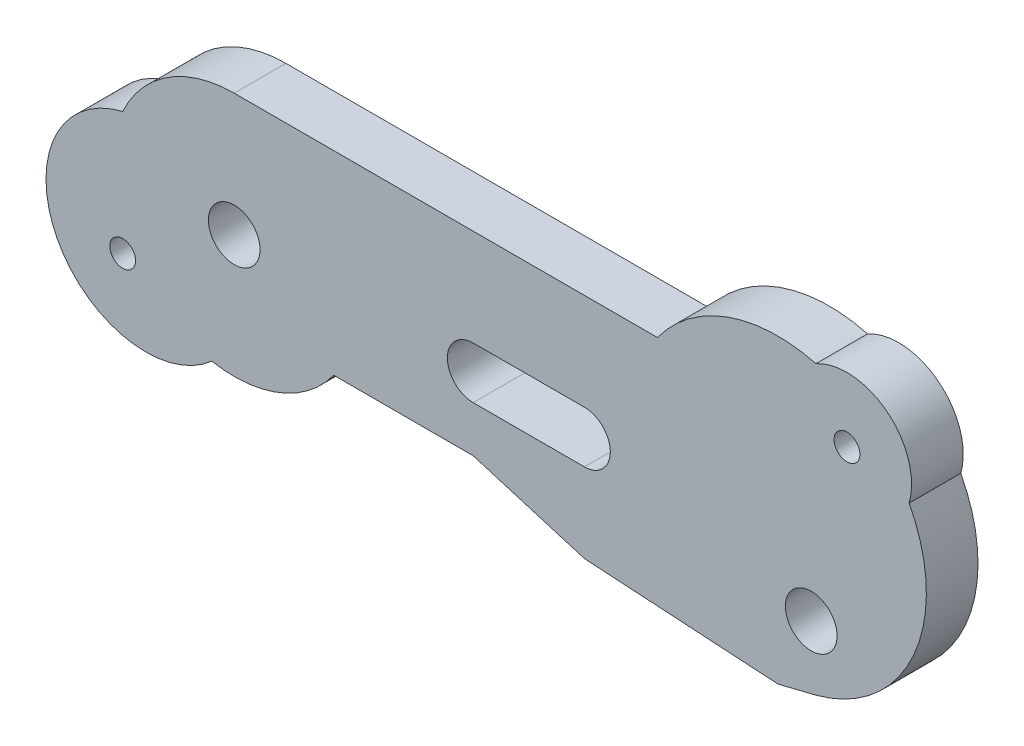
ISO-10303-21;
HEADER;
FILE_DESCRIPTION(('STEP AP214'),'2;1');
FILE_NAME('part.step','',(''),(''),'','','');
FILE_SCHEMA(('AUTOMOTIVE_DESIGN { 1 0 10303 214 1 1 1 1 }'));
ENDSEC;
DATA;
#1=APPLICATION_CONTEXT('core data for automotive mechanical design processes');
#2=APPLICATION_PROTOCOL_DEFINITION('international standard','automotive_design',2000,#1);
#3=PRODUCT_CONTEXT('',#1,'mechanical');
#4=PRODUCT('Part','Part','',(#3));
#5=PRODUCT_RELATED_PRODUCT_CATEGORY('part','',(#4));
#6=PRODUCT_DEFINITION_FORMATION('','',#4);
#7=PRODUCT_DEFINITION_CONTEXT('part definition',#1,'design');
#8=PRODUCT_DEFINITION('design','',#6,#7);
#9=PRODUCT_DEFINITION_SHAPE('','',#8);
#10=(LENGTH_UNIT() NAMED_UNIT(*) SI_UNIT(.MILLI.,.METRE.));
#11=(NAMED_UNIT(*) PLANE_ANGLE_UNIT() SI_UNIT($,.RADIAN.));
#12=(NAMED_UNIT(*) SI_UNIT($,.STERADIAN.) SOLID_ANGLE_UNIT());
#13=UNCERTAINTY_MEASURE_WITH_UNIT(LENGTH_MEASURE(1.E-05),#10,'distance_accuracy_value','');
#14=(GEOMETRIC_REPRESENTATION_CONTEXT(3) GLOBAL_UNCERTAINTY_ASSIGNED_CONTEXT((#13)) GLOBAL_UNIT_ASSIGNED_CONTEXT((#10,
#11,#12)) REPRESENTATION_CONTEXT('',''));
#15=CARTESIAN_POINT('',(0.,0.,0.));
#16=DIRECTION('',(0.,0.,1.));
#17=DIRECTION('',(1.,0.,0.));
#18=AXIS2_PLACEMENT_3D('',#15,#16,#17);
#19=CARTESIAN_POINT('',(-6.8535106210475,-3.55855359169775,4.));
#20=DIRECTION('',(0.,0.,-1.));
#21=DIRECTION('',(-1.,0.,0.));
#22=AXIS2_PLACEMENT_3D('',#19,#20,#21);
#23=CYLINDRICAL_SURFACE('',#22,7.72229962496897);
#24=CARTESIAN_POINT('',(-6.8535106210475,-3.55855359169775,0.));
#25=DIRECTION('',(0.,0.,1.));
#26=DIRECTION('',(1.,0.,0.));
#27=AXIS2_PLACEMENT_3D('',#24,#25,#26);
#28=CIRCLE('',#27,7.72229962496897);
#29=CARTESIAN_POINT('',(-8.63767689924236,3.95481197837457,0.));
#30=VERTEX_POINT('',#29);
#31=CARTESIAN_POINT('',(-1.73443048084118,-9.3403292718795,0.));
#32=VERTEX_POINT('',#31);
#33=EDGE_CURVE('E200',#30,#32,#28,.T.);
#34=ORIENTED_EDGE('',*,*,#33,.T.);
#35=DIRECTION('',(0.,0.,-1.));
#36=VECTOR('',#35,1.);
#37=CARTESIAN_POINT('',(-1.73443048084118,-9.3403292718795,4.));
#38=LINE('',#37,#36);
#39=CARTESIAN_POINT('',(-1.73443048084118,-9.3403292718795,4.));
#40=VERTEX_POINT('',#39);
#41=EDGE_CURVE('E11',#40,#32,#38,.T.);
#42=ORIENTED_EDGE('',*,*,#41,.F.);
#43=CARTESIAN_POINT('',(-6.8535106210475,-3.55855359169775,4.));
#44=DIRECTION('',(0.,0.,1.));
#45=DIRECTION('',(1.,0.,0.));
#46=AXIS2_PLACEMENT_3D('',#43,#44,#45);
#47=CIRCLE('',#46,7.72229962496897);
#48=CARTESIAN_POINT('',(-8.63767689924236,3.95481197837457,4.));
#49=VERTEX_POINT('',#48);
#50=EDGE_CURVE('E282',#49,#40,#47,.T.);
#51=ORIENTED_EDGE('',*,*,#50,.F.);
#52=DIRECTION('',(0.,0.,-1.));
#53=VECTOR('',#52,1.);
#54=CARTESIAN_POINT('',(-8.63767689924236,3.95481197837457,4.));
#55=LINE('',#54,#53);
#56=EDGE_CURVE('E222',#49,#30,#55,.T.);
#57=ORIENTED_EDGE('',*,*,#56,.T.);
#58=EDGE_LOOP('',(#34,#42,#51,#57));
#59=FACE_BOUND('',#58,.T.);
#60=ADVANCED_FACE('F35',(#59),#23,.T.);
#61=CARTESIAN_POINT('',(0.,0.,4.));
#62=DIRECTION('',(0.,0.,-1.));
#63=DIRECTION('',(-1.,0.,0.));
#64=AXIS2_PLACEMENT_3D('',#61,#62,#63);
#65=CYLINDRICAL_SURFACE('',#64,9.5);
#66=CARTESIAN_POINT('',(0.,0.,0.));
#67=DIRECTION('',(0.,0.,1.));
#68=DIRECTION('',(1.,0.,0.));
#69=AXIS2_PLACEMENT_3D('',#66,#67,#68);
#70=CIRCLE('',#69,9.5);
#71=CARTESIAN_POINT('',(7.70145266979888,-5.56216026152139,0.));
#72=VERTEX_POINT('',#71);
#73=EDGE_CURVE('E203',#32,#72,#70,.T.);
#74=ORIENTED_EDGE('',*,*,#73,.T.);
#75=DIRECTION('',(0.,0.,-1.));
#76=VECTOR('',#75,1.);
#77=CARTESIAN_POINT('',(7.70145266979888,-5.56216026152139,4.));
#78=LINE('',#77,#76);
#79=CARTESIAN_POINT('',(7.70145266979888,-5.56216026152139,4.));
#80=VERTEX_POINT('',#79);
#81=EDGE_CURVE('E45',#80,#72,#78,.T.);
#82=ORIENTED_EDGE('',*,*,#81,.F.);
#83=CARTESIAN_POINT('',(0.,0.,4.));
#84=DIRECTION('',(0.,0.,1.));
#85=DIRECTION('',(1.,0.,0.));
#86=AXIS2_PLACEMENT_3D('',#83,#84,#85);
#87=CIRCLE('',#86,9.5);
#88=EDGE_CURVE('E284',#40,#80,#87,.T.);
#89=ORIENTED_EDGE('',*,*,#88,.F.);
#90=ORIENTED_EDGE('',*,*,#41,.T.);
#91=EDGE_LOOP('',(#74,#82,#89,#90));
#92=FACE_BOUND('',#91,.T.);
#93=ADVANCED_FACE('F325',(#92),#65,.T.);
#94=CARTESIAN_POINT('',(0.,-5.56216026152139,4.));
#95=DIRECTION('',(0.,1.,0.));
#96=DIRECTION('',(-1.,0.,0.));
#97=AXIS2_PLACEMENT_3D('',#94,#95,#96);
#98=PLANE('',#97);
#99=DIRECTION('',(1.,0.,0.));
#100=VECTOR('',#99,1.);
#101=CARTESIAN_POINT('',(0.,-5.56216026152139,0.));
#102=LINE('',#101,#100);
#103=CARTESIAN_POINT('',(18.5014526697989,-5.56216026152139,0.));
#104=VERTEX_POINT('',#103);
#105=EDGE_CURVE('E205',#72,#104,#102,.T.);
#106=ORIENTED_EDGE('',*,*,#105,.T.);
#107=DIRECTION('',(0.,0.,-1.));
#108=VECTOR('',#107,1.);
#109=CARTESIAN_POINT('',(18.5014526697989,-5.56216026152139,4.));
#110=LINE('',#109,#108);
#111=CARTESIAN_POINT('',(18.5014526697989,-5.56216026152139,4.));
#112=VERTEX_POINT('',#111);
#113=EDGE_CURVE('E238',#112,#104,#110,.T.);
#114=ORIENTED_EDGE('',*,*,#113,.F.);
#115=DIRECTION('',(1.,0.,0.));
#116=VECTOR('',#115,1.);
#117=CARTESIAN_POINT('',(0.,-5.56216026152139,4.));
#118=LINE('',#117,#116);
#119=EDGE_CURVE('E286',#80,#112,#118,.T.);
#120=ORIENTED_EDGE('',*,*,#119,.F.);
#121=ORIENTED_EDGE('',*,*,#81,.T.);
#122=EDGE_LOOP('',(#106,#114,#120,#121));
#123=FACE_BOUND('',#122,.T.);
#124=ADVANCED_FACE('F330',(#123),#98,.F.);
#125=CARTESIAN_POINT('',(0.,0.,4.));
#126=DIRECTION('',(0.28790460145011,0.957659094074636,0.));
#127=DIRECTION('',(-0.957659094074636,0.28790460145011,0.));
#128=AXIS2_PLACEMENT_3D('',#125,#126,#127);
#129=PLANE('',#128);
#130=DIRECTION('',(0.957659094074636,-0.28790460145011,0.));
#131=VECTOR('',#130,1.);
#132=CARTESIAN_POINT('',(0.,0.,0.));
#133=LINE('',#132,#131);
#134=CARTESIAN_POINT('',(27.1203845164706,-8.15330167457238,0.));
#135=VERTEX_POINT('',#134);
#136=EDGE_CURVE('E207',#104,#135,#133,.T.);
#137=ORIENTED_EDGE('',*,*,#136,.T.);
#138=DIRECTION('',(0.,0.,-1.));
#139=VECTOR('',#138,1.);
#140=CARTESIAN_POINT('',(27.1203845164706,-8.15330167457238,4.));
#141=LINE('',#140,#139);
#142=CARTESIAN_POINT('',(27.1203845164706,-8.15330167457238,4.));
#143=VERTEX_POINT('',#142);
#144=EDGE_CURVE('E235',#143,#135,#141,.T.);
#145=ORIENTED_EDGE('',*,*,#144,.F.);
#146=DIRECTION('',(0.957659094074636,-0.28790460145011,0.));
#147=VECTOR('',#146,1.);
#148=CARTESIAN_POINT('',(0.,0.,4.));
#149=LINE('',#148,#147);
#150=EDGE_CURVE('E288',#112,#143,#149,.T.);
#151=ORIENTED_EDGE('',*,*,#150,.F.);
#152=ORIENTED_EDGE('',*,*,#113,.T.);
#153=EDGE_LOOP('',(#137,#145,#151,#152));
#154=FACE_BOUND('',#153,.T.);
#155=ADVANCED_FACE('F471',(#154),#129,.F.);
#156=CARTESIAN_POINT('',(-0.397201821396312,-6.46182308165664,4.));
#157=DIRECTION('',(0.0613532024835594,0.998116117766371,0.));
#158=DIRECTION('',(-0.998116117766371,0.0613532024835594,0.));
#159=AXIS2_PLACEMENT_3D('',#156,#157,#158);
#160=PLANE('',#159);
#161=DIRECTION('',(0.998116117766371,-0.0613532024835594,0.));
#162=VECTOR('',#161,1.);
#163=CARTESIAN_POINT('',(-0.397201821396312,-6.46182308165664,0.));
#164=LINE('',#163,#162);
#165=CARTESIAN_POINT('',(42.0921262829662,-9.07359971182577,0.));
#166=VERTEX_POINT('',#165);
#167=EDGE_CURVE('E209',#135,#166,#164,.T.);
#168=ORIENTED_EDGE('',*,*,#167,.T.);
#169=DIRECTION('',(0.,0.,-1.));
#170=VECTOR('',#169,1.);
#171=CARTESIAN_POINT('',(42.0921262829662,-9.07359971182577,4.));
#172=LINE('',#171,#170);
#173=CARTESIAN_POINT('',(42.0921262829662,-9.07359971182577,4.));
#174=VERTEX_POINT('',#173);
#175=EDGE_CURVE('E232',#174,#166,#172,.T.);
#176=ORIENTED_EDGE('',*,*,#175,.F.);
#177=DIRECTION('',(0.998116117766371,-0.0613532024835594,0.));
#178=VECTOR('',#177,1.);
#179=CARTESIAN_POINT('',(-0.397201821396312,-6.46182308165664,4.));
#180=LINE('',#179,#178);
#181=EDGE_CURVE('E290',#143,#174,#180,.T.);
#182=ORIENTED_EDGE('',*,*,#181,.F.);
#183=ORIENTED_EDGE('',*,*,#144,.T.);
#184=EDGE_LOOP('',(#168,#176,#182,#183));
#185=FACE_BOUND('',#184,.T.);
#186=ADVANCED_FACE('F461',(#185),#160,.F.);
#187=CARTESIAN_POINT('',(4.50419794646677,-18.3167135914125,4.));
#188=DIRECTION('',(-0.238792522949214,0.971070610709411,0.));
#189=DIRECTION('',(-0.971070610709411,-0.238792522949214,0.));
#190=AXIS2_PLACEMENT_3D('',#187,#188,#189);
#191=PLANE('',#190);
#192=DIRECTION('',(0.971070610709411,0.238792522949214,0.));
#193=VECTOR('',#192,1.);
#194=CARTESIAN_POINT('',(4.50419794646677,-18.3167135914125,0.));
#195=LINE('',#194,#193);
#196=CARTESIAN_POINT('',(44.9992625957666,-8.35871615234523,0.));
#197=VERTEX_POINT('',#196);
#198=EDGE_CURVE('E211',#166,#197,#195,.T.);
#199=ORIENTED_EDGE('',*,*,#198,.T.);
#200=DIRECTION('',(0.,0.,-1.));
#201=VECTOR('',#200,1.);
#202=CARTESIAN_POINT('',(44.9992625957666,-8.35871615234523,4.));
#203=LINE('',#202,#201);
#204=CARTESIAN_POINT('',(44.9992625957666,-8.35871615234523,4.));
#205=VERTEX_POINT('',#204);
#206=EDGE_CURVE('E229',#205,#197,#203,.T.);
#207=ORIENTED_EDGE('',*,*,#206,.F.);
#208=DIRECTION('',(0.971070610709411,0.238792522949214,0.));
#209=VECTOR('',#208,1.);
#210=CARTESIAN_POINT('',(4.50419794646677,-18.3167135914125,4.));
#211=LINE('',#210,#209);
#212=EDGE_CURVE('E292',#174,#205,#211,.T.);
#213=ORIENTED_EDGE('',*,*,#212,.F.);
#214=ORIENTED_EDGE('',*,*,#175,.T.);
#215=EDGE_LOOP('',(#199,#207,#213,#214));
#216=FACE_BOUND('',#215,.T.);
#217=ADVANCED_FACE('F452',(#216),#191,.F.);
#218=CARTESIAN_POINT('',(42.0921262829662,2.7677639046538,4.));
#219=DIRECTION('',(0.,0.,-1.));
#220=DIRECTION('',(-1.,0.,0.));
#221=AXIS2_PLACEMENT_3D('',#218,#219,#220);
#222=CYLINDRICAL_SURFACE('',#221,11.5);
#223=CARTESIAN_POINT('',(42.0921262829662,2.7677639046538,0.));
#224=DIRECTION('',(0.,0.,1.));
#225=DIRECTION('',(1.,0.,0.));
#226=AXIS2_PLACEMENT_3D('',#223,#224,#225);
#227=CIRCLE('',#226,11.5);
#228=CARTESIAN_POINT('',(52.2593206223263,8.14160417634817,0.));
#229=VERTEX_POINT('',#228);
#230=EDGE_CURVE('E213',#197,#229,#227,.T.);
#231=ORIENTED_EDGE('',*,*,#230,.T.);
#232=DIRECTION('',(0.,0.,-1.));
#233=VECTOR('',#232,1.);
#234=CARTESIAN_POINT('',(52.2593206223263,8.14160417634817,4.));
#235=LINE('',#234,#233);
#236=CARTESIAN_POINT('',(52.2593206223263,8.14160417634817,4.));
#237=VERTEX_POINT('',#236);
#238=EDGE_CURVE('E226',#237,#229,#235,.T.);
#239=ORIENTED_EDGE('',*,*,#238,.F.);
#240=CARTESIAN_POINT('',(42.0921262829662,2.7677639046538,4.));
#241=DIRECTION('',(0.,0.,1.));
#242=DIRECTION('',(1.,0.,0.));
#243=AXIS2_PLACEMENT_3D('',#240,#241,#242);
#244=CIRCLE('',#243,11.5);
#245=EDGE_CURVE('E294',#205,#237,#244,.T.);
#246=ORIENTED_EDGE('',*,*,#245,.F.);
#247=ORIENTED_EDGE('',*,*,#206,.T.);
#248=EDGE_LOOP('',(#231,#239,#246,#247));
#249=FACE_BOUND('',#248,.T.);
#250=ADVANCED_FACE('F300',(#249),#222,.T.);
#251=CARTESIAN_POINT('',(47.4473812226366,9.5,4.));
#252=DIRECTION('',(0.,0.,-1.));
#253=DIRECTION('',(-1.,0.,0.));
#254=AXIS2_PLACEMENT_3D('',#251,#252,#253);
#255=CYLINDRICAL_SURFACE('',#254,5.);
#256=CARTESIAN_POINT('',(47.4473812226366,9.5,0.));
#257=DIRECTION('',(0.,0.,1.));
#258=DIRECTION('',(1.,0.,0.));
#259=AXIS2_PLACEMENT_3D('',#256,#257,#258);
#260=CIRCLE('',#259,5.);
#261=CARTESIAN_POINT('',(45.0415037138231,13.8831214234362,0.));
#262=VERTEX_POINT('',#261);
#263=EDGE_CURVE('E215',#229,#262,#260,.T.);
#264=ORIENTED_EDGE('',*,*,#263,.T.);
#265=DIRECTION('',(0.,0.,-1.));
#266=VECTOR('',#265,1.);
#267=CARTESIAN_POINT('',(45.0415037138231,13.8831214234362,4.));
#268=LINE('',#267,#266);
#269=CARTESIAN_POINT('',(45.0415037138231,13.8831214234362,4.));
#270=VERTEX_POINT('',#269);
#271=EDGE_CURVE('E168',#270,#262,#268,.T.);
#272=ORIENTED_EDGE('',*,*,#271,.F.);
#273=CARTESIAN_POINT('',(47.4473812226366,9.5,4.));
#274=DIRECTION('',(0.,0.,1.));
#275=DIRECTION('',(1.,0.,0.));
#276=AXIS2_PLACEMENT_3D('',#273,#274,#275);
#277=CIRCLE('',#276,5.);
#278=EDGE_CURVE('E155',#237,#270,#277,.T.);
#279=ORIENTED_EDGE('',*,*,#278,.F.);
#280=ORIENTED_EDGE('',*,*,#238,.T.);
#281=EDGE_LOOP('',(#264,#272,#279,#280));
#282=FACE_BOUND('',#281,.T.);
#283=ADVANCED_FACE('F304',(#282),#255,.T.);
#284=CARTESIAN_POINT('',(42.0921262829662,2.7677639046538,4.));
#285=DIRECTION('',(0.,0.,-1.));
#286=DIRECTION('',(-1.,0.,0.));
#287=AXIS2_PLACEMENT_3D('',#284,#285,#286);
#288=CYLINDRICAL_SURFACE('',#287,11.5);
#289=CARTESIAN_POINT('',(42.0921262829662,2.7677639046538,0.));
#290=DIRECTION('',(0.,0.,1.));
#291=DIRECTION('',(1.,0.,0.));
#292=AXIS2_PLACEMENT_3D('',#289,#290,#291);
#293=CIRCLE('',#292,11.5);
#294=CARTESIAN_POINT('',(32.7686614143394,9.5,0.));
#295=VERTEX_POINT('',#294);
#296=EDGE_CURVE('E164',#262,#295,#293,.T.);
#297=ORIENTED_EDGE('',*,*,#296,.T.);
#298=DIRECTION('',(0.,0.,-1.));
#299=VECTOR('',#298,1.);
#300=CARTESIAN_POINT('',(32.7686614143394,9.5,4.));
#301=LINE('',#300,#299);
#302=CARTESIAN_POINT('',(32.7686614143394,9.5,4.));
#303=VERTEX_POINT('',#302);
#304=EDGE_CURVE('E161',#303,#295,#301,.T.);
#305=ORIENTED_EDGE('',*,*,#304,.F.);
#306=CARTESIAN_POINT('',(42.0921262829662,2.7677639046538,4.));
#307=DIRECTION('',(0.,0.,1.));
#308=DIRECTION('',(1.,0.,0.));
#309=AXIS2_PLACEMENT_3D('',#306,#307,#308);
#310=CIRCLE('',#309,11.5);
#311=EDGE_CURVE('E149',#270,#303,#310,.T.);
#312=ORIENTED_EDGE('',*,*,#311,.F.);
#313=ORIENTED_EDGE('',*,*,#271,.T.);
#314=EDGE_LOOP('',(#297,#305,#312,#313));
#315=FACE_BOUND('',#314,.T.);
#316=ADVANCED_FACE('F162',(#315),#288,.T.);
#317=CARTESIAN_POINT('',(0.,9.5,4.));
#318=DIRECTION('',(0.,1.,0.));
#319=DIRECTION('',(0.,0.,1.));
#320=AXIS2_PLACEMENT_3D('',#317,#318,#319);
#321=PLANE('',#320);
#322=DIRECTION('',(1.,0.,0.));
#323=VECTOR('',#322,1.);
#324=CARTESIAN_POINT('',(0.,9.5,0.));
#325=LINE('',#324,#323);
#326=CARTESIAN_POINT('',(0.,9.5,0.));
#327=VERTEX_POINT('',#326);
#328=EDGE_CURVE('E218',#327,#295,#325,.T.);
#329=ORIENTED_EDGE('',*,*,#328,.F.);
#330=DIRECTION('',(0.,0.,-1.));
#331=VECTOR('',#330,1.);
#332=CARTESIAN_POINT('',(0.,9.5,4.));
#333=LINE('',#332,#331);
#334=CARTESIAN_POINT('',(0.,9.5,4.));
#335=VERTEX_POINT('',#334);
#336=EDGE_CURVE('E103',#335,#327,#333,.T.);
#337=ORIENTED_EDGE('',*,*,#336,.F.);
#338=DIRECTION('',(1.,0.,0.));
#339=VECTOR('',#338,1.);
#340=CARTESIAN_POINT('',(0.,9.5,4.));
#341=LINE('',#340,#339);
#342=EDGE_CURVE('E153',#335,#303,#341,.T.);
#343=ORIENTED_EDGE('',*,*,#342,.T.);
#344=ORIENTED_EDGE('',*,*,#304,.T.);
#345=EDGE_LOOP('',(#329,#337,#343,#344));
#346=FACE_BOUND('',#345,.T.);
#347=ADVANCED_FACE('F170',(#346),#321,.T.);
#348=CARTESIAN_POINT('',(27.1203845164706,0.,4.));
#349=DIRECTION('',(0.,0.,-1.));
#350=DIRECTION('',(-1.,0.,0.));
#351=AXIS2_PLACEMENT_3D('',#348,#349,#350);
#352=CYLINDRICAL_SURFACE('',#351,2.);
#353=CARTESIAN_POINT('',(27.1203845164706,0.,0.));
#354=DIRECTION('',(0.,0.,1.));
#355=DIRECTION('',(1.,0.,0.));
#356=AXIS2_PLACEMENT_3D('',#353,#354,#355);
#357=CIRCLE('',#356,2.);
#358=CARTESIAN_POINT('',(27.1203845164706,-2.,0.));
#359=VERTEX_POINT('',#358);
#360=CARTESIAN_POINT('',(27.1203845164706,2.,0.));
#361=VERTEX_POINT('',#360);
#362=EDGE_CURVE('E182',#359,#361,#357,.T.);
#363=ORIENTED_EDGE('',*,*,#362,.F.);
#364=DIRECTION('',(0.,0.,-1.));
#365=VECTOR('',#364,1.);
#366=CARTESIAN_POINT('',(27.1203845164706,-2.,4.));
#367=LINE('',#366,#365);
#368=CARTESIAN_POINT('',(27.1203845164706,-2.,4.));
#369=VERTEX_POINT('',#368);
#370=EDGE_CURVE('E39',#369,#359,#367,.T.);
#371=ORIENTED_EDGE('',*,*,#370,.F.);
#372=CARTESIAN_POINT('',(27.1203845164706,0.,4.));
#373=DIRECTION('',(0.,0.,1.));
#374=DIRECTION('',(1.,0.,0.));
#375=AXIS2_PLACEMENT_3D('',#372,#373,#374);
#376=CIRCLE('',#375,2.);
#377=CARTESIAN_POINT('',(27.1203845164706,2.,4.));
#378=VERTEX_POINT('',#377);
#379=EDGE_CURVE('E273',#369,#378,#376,.T.);
#380=ORIENTED_EDGE('',*,*,#379,.T.);
#381=DIRECTION('',(0.,0.,-1.));
#382=VECTOR('',#381,1.);
#383=CARTESIAN_POINT('',(27.1203845164706,2.,4.));
#384=LINE('',#383,#382);
#385=EDGE_CURVE('E172',#378,#361,#384,.T.);
#386=ORIENTED_EDGE('',*,*,#385,.T.);
#387=EDGE_LOOP('',(#363,#371,#380,#386));
#388=FACE_BOUND('',#387,.T.);
#389=ADVANCED_FACE('F255',(#388),#352,.F.);
#390=CARTESIAN_POINT('',(0.,-2.,4.));
#391=DIRECTION('',(0.,1.,0.));
#392=DIRECTION('',(0.,0.,1.));
#393=AXIS2_PLACEMENT_3D('',#390,#391,#392);
#394=PLANE('',#393);
#395=DIRECTION('',(1.,0.,0.));
#396=VECTOR('',#395,1.);
#397=CARTESIAN_POINT('',(0.,-2.,0.));
#398=LINE('',#397,#396);
#399=CARTESIAN_POINT('',(18.5014526697989,-2.,0.));
#400=VERTEX_POINT('',#399);
#401=EDGE_CURVE('E185',#400,#359,#398,.T.);
#402=ORIENTED_EDGE('',*,*,#401,.F.);
#403=DIRECTION('',(0.,0.,-1.));
#404=VECTOR('',#403,1.);
#405=CARTESIAN_POINT('',(18.5014526697989,-2.,4.));
#406=LINE('',#405,#404);
#407=CARTESIAN_POINT('',(18.5014526697989,-2.,4.));
#408=VERTEX_POINT('',#407);
#409=EDGE_CURVE('E245',#408,#400,#406,.T.);
#410=ORIENTED_EDGE('',*,*,#409,.F.);
#411=DIRECTION('',(1.,0.,0.));
#412=VECTOR('',#411,1.);
#413=CARTESIAN_POINT('',(0.,-2.,4.));
#414=LINE('',#413,#412);
#415=EDGE_CURVE('E254',#408,#369,#414,.T.);
#416=ORIENTED_EDGE('',*,*,#415,.T.);
#417=ORIENTED_EDGE('',*,*,#370,.T.);
#418=EDGE_LOOP('',(#402,#410,#416,#417));
#419=FACE_BOUND('',#418,.T.);
#420=ADVANCED_FACE('F252',(#419),#394,.T.);
#421=CARTESIAN_POINT('',(18.5014526697989,0.,4.));
#422=DIRECTION('',(0.,0.,-1.));
#423=DIRECTION('',(-1.,0.,0.));
#424=AXIS2_PLACEMENT_3D('',#421,#422,#423);
#425=CYLINDRICAL_SURFACE('',#424,2.);
#426=CARTESIAN_POINT('',(18.5014526697989,0.,0.));
#427=DIRECTION('',(0.,0.,1.));
#428=DIRECTION('',(1.,0.,0.));
#429=AXIS2_PLACEMENT_3D('',#426,#427,#428);
#430=CIRCLE('',#429,2.);
#431=CARTESIAN_POINT('',(18.5014526697989,2.,0.));
#432=VERTEX_POINT('',#431);
#433=EDGE_CURVE('E188',#432,#400,#430,.T.);
#434=ORIENTED_EDGE('',*,*,#433,.F.);
#435=DIRECTION('',(0.,0.,-1.));
#436=VECTOR('',#435,1.);
#437=CARTESIAN_POINT('',(18.5014526697989,2.,4.));
#438=LINE('',#437,#436);
#439=CARTESIAN_POINT('',(18.5014526697989,2.,4.));
#440=VERTEX_POINT('',#439);
#441=EDGE_CURVE('E244',#440,#432,#438,.T.);
#442=ORIENTED_EDGE('',*,*,#441,.F.);
#443=CARTESIAN_POINT('',(18.5014526697989,0.,4.));
#444=DIRECTION('',(0.,0.,1.));
#445=DIRECTION('',(1.,0.,0.));
#446=AXIS2_PLACEMENT_3D('',#443,#444,#445);
#447=CIRCLE('',#446,2.);
#448=EDGE_CURVE('E264',#440,#408,#447,.T.);
#449=ORIENTED_EDGE('',*,*,#448,.T.);
#450=ORIENTED_EDGE('',*,*,#409,.T.);
#451=EDGE_LOOP('',(#434,#442,#449,#450));
#452=FACE_BOUND('',#451,.T.);
#453=ADVANCED_FACE('F261',(#452),#425,.F.);
#454=CARTESIAN_POINT('',(44.6766449908327,-3.55855359169775,4.));
#455=DIRECTION('',(0.,0.,-1.));
#456=DIRECTION('',(-1.,0.,0.));
#457=AXIS2_PLACEMENT_3D('',#454,#455,#456);
#458=CYLINDRICAL_SURFACE('',#457,2.);
#459=CARTESIAN_POINT('',(44.6766449908327,-3.55855359169775,4.));
#460=DIRECTION('',(0.,0.,1.));
#461=DIRECTION('',(1.,0.,0.));
#462=AXIS2_PLACEMENT_3D('',#459,#460,#461);
#463=CIRCLE('',#462,2.);
#464=CARTESIAN_POINT('',(46.6766449908327,-3.55855359169775,4.));
#465=VERTEX_POINT('',#464);
#466=EDGE_CURVE('E279',#465,#465,#463,.T.);
#467=ORIENTED_EDGE('',*,*,#466,.T.);
#468=EDGE_LOOP('',(#467));
#469=FACE_BOUND('',#468,.T.);
#470=CARTESIAN_POINT('',(44.6766449908327,-3.55855359169775,0.));
#471=DIRECTION('',(0.,0.,1.));
#472=DIRECTION('',(1.,0.,0.));
#473=AXIS2_PLACEMENT_3D('',#470,#471,#472);
#474=CIRCLE('',#473,2.);
#475=CARTESIAN_POINT('',(46.6766449908327,-3.55855359169775,0.));
#476=VERTEX_POINT('',#475);
#477=EDGE_CURVE('E197',#476,#476,#474,.T.);
#478=ORIENTED_EDGE('',*,*,#477,.F.);
#479=EDGE_LOOP('',(#478));
#480=FACE_BOUND('',#479,.T.);
#481=ADVANCED_FACE('F335',(#469,#480),#458,.F.);
#482=CARTESIAN_POINT('',(47.4473812226366,9.5,4.));
#483=DIRECTION('',(0.,0.,-1.));
#484=DIRECTION('',(-1.,0.,0.));
#485=AXIS2_PLACEMENT_3D('',#482,#483,#484);
#486=CYLINDRICAL_SURFACE('',#485,0.999999999999998);
#487=CARTESIAN_POINT('',(47.4473812226366,9.5,4.));
#488=DIRECTION('',(0.,0.,1.));
#489=DIRECTION('',(1.,0.,0.));
#490=AXIS2_PLACEMENT_3D('',#487,#488,#489);
#491=CIRCLE('',#490,0.999999999999998);
#492=CARTESIAN_POINT('',(48.4473812226366,9.5,4.));
#493=VERTEX_POINT('',#492);
#494=EDGE_CURVE('E269',#493,#493,#491,.T.);
#495=ORIENTED_EDGE('',*,*,#494,.T.);
#496=EDGE_LOOP('',(#495));
#497=FACE_BOUND('',#496,.T.);
#498=CARTESIAN_POINT('',(47.4473812226366,9.5,0.));
#499=DIRECTION('',(0.,0.,1.));
#500=DIRECTION('',(1.,0.,0.));
#501=AXIS2_PLACEMENT_3D('',#498,#499,#500);
#502=CIRCLE('',#501,0.999999999999998);
#503=CARTESIAN_POINT('',(48.4473812226366,9.5,0.));
#504=VERTEX_POINT('',#503);
#505=EDGE_CURVE('E194',#504,#504,#502,.T.);
#506=ORIENTED_EDGE('',*,*,#505,.F.);
#507=EDGE_LOOP('',(#506));
#508=FACE_BOUND('',#507,.T.);
#509=ADVANCED_FACE('F338',(#497,#508),#486,.F.);
#510=CARTESIAN_POINT('',(0.,2.,4.));
#511=DIRECTION('',(0.,1.,0.));
#512=DIRECTION('',(0.,0.,1.));
#513=AXIS2_PLACEMENT_3D('',#510,#511,#512);
#514=PLANE('',#513);
#515=DIRECTION('',(1.,0.,0.));
#516=VECTOR('',#515,1.);
#517=CARTESIAN_POINT('',(0.,2.,0.));
#518=LINE('',#517,#516);
#519=EDGE_CURVE('E191',#432,#361,#518,.T.);
#520=ORIENTED_EDGE('',*,*,#519,.T.);
#521=ORIENTED_EDGE('',*,*,#385,.F.);
#522=DIRECTION('',(1.,0.,0.));
#523=VECTOR('',#522,1.);
#524=CARTESIAN_POINT('',(0.,2.,4.));
#525=LINE('',#524,#523);
#526=EDGE_CURVE('E266',#440,#378,#525,.T.);
#527=ORIENTED_EDGE('',*,*,#526,.F.);
#528=ORIENTED_EDGE('',*,*,#441,.T.);
#529=EDGE_LOOP('',(#520,#521,#527,#528));
#530=FACE_BOUND('',#529,.T.);
#531=ADVANCED_FACE('F267',(#530),#514,.F.);
#532=CARTESIAN_POINT('',(0.,0.,4.));
#533=DIRECTION('',(0.,0.,-1.));
#534=DIRECTION('',(-1.,0.,0.));
#535=AXIS2_PLACEMENT_3D('',#532,#533,#534);
#536=CYLINDRICAL_SURFACE('',#535,2.);
#537=CARTESIAN_POINT('',(0.,0.,4.));
#538=DIRECTION('',(0.,0.,1.));
#539=DIRECTION('',(1.,0.,0.));
#540=AXIS2_PLACEMENT_3D('',#537,#538,#539);
#541=CIRCLE('',#540,2.);
#542=CARTESIAN_POINT('',(2.,0.,4.));
#543=VERTEX_POINT('',#542);
#544=EDGE_CURVE('E357',#543,#543,#541,.T.);
#545=ORIENTED_EDGE('',*,*,#544,.T.);
#546=EDGE_LOOP('',(#545));
#547=FACE_BOUND('',#546,.T.);
#548=CARTESIAN_POINT('',(0.,0.,0.));
#549=DIRECTION('',(0.,0.,1.));
#550=DIRECTION('',(1.,0.,0.));
#551=AXIS2_PLACEMENT_3D('',#548,#549,#550);
#552=CIRCLE('',#551,2.);
#553=CARTESIAN_POINT('',(2.,0.,0.));
#554=VERTEX_POINT('',#553);
#555=EDGE_CURVE('E179',#554,#554,#552,.T.);
#556=ORIENTED_EDGE('',*,*,#555,.F.);
#557=EDGE_LOOP('',(#556));
#558=FACE_BOUND('',#557,.T.);
#559=ADVANCED_FACE('F320',(#547,#558),#536,.F.);
#560=CARTESIAN_POINT('',(-8.63767689924236,-5.56216026152139,4.));
#561=DIRECTION('',(0.,0.,-1.));
#562=DIRECTION('',(-1.,0.,0.));
#563=AXIS2_PLACEMENT_3D('',#560,#561,#562);
#564=CYLINDRICAL_SURFACE('',#563,1.);
#565=CARTESIAN_POINT('',(-8.63767689924236,-5.56216026152139,4.));
#566=DIRECTION('',(0.,0.,1.));
#567=DIRECTION('',(1.,0.,0.));
#568=AXIS2_PLACEMENT_3D('',#565,#566,#567);
#569=CIRCLE('',#568,1.);
#570=CARTESIAN_POINT('',(-7.63767689924236,-5.56216026152139,4.));
#571=VERTEX_POINT('',#570);
#572=EDGE_CURVE('E221',#571,#571,#569,.T.);
#573=ORIENTED_EDGE('',*,*,#572,.T.);
#574=EDGE_LOOP('',(#573));
#575=FACE_BOUND('',#574,.T.);
#576=CARTESIAN_POINT('',(-8.63767689924236,-5.56216026152139,0.));
#577=DIRECTION('',(0.,0.,1.));
#578=DIRECTION('',(1.,0.,0.));
#579=AXIS2_PLACEMENT_3D('',#576,#577,#578);
#580=CIRCLE('',#579,1.);
#581=CARTESIAN_POINT('',(-7.63767689924236,-5.56216026152139,0.));
#582=VERTEX_POINT('',#581);
#583=EDGE_CURVE('E176',#582,#582,#580,.T.);
#584=ORIENTED_EDGE('',*,*,#583,.F.);
#585=EDGE_LOOP('',(#584));
#586=FACE_BOUND('',#585,.T.);
#587=ADVANCED_FACE('F37',(#575,#586),#564,.F.);
#588=CARTESIAN_POINT('',(0.,0.,4.));
#589=DIRECTION('',(0.,0.,-1.));
#590=DIRECTION('',(-1.,0.,0.));
#591=AXIS2_PLACEMENT_3D('',#588,#589,#590);
#592=CYLINDRICAL_SURFACE('',#591,9.5);
#593=CARTESIAN_POINT('',(0.,0.,0.));
#594=DIRECTION('',(0.,0.,1.));
#595=DIRECTION('',(1.,0.,0.));
#596=AXIS2_PLACEMENT_3D('',#593,#594,#595);
#597=CIRCLE('',#596,9.5);
#598=EDGE_CURVE('E106',#327,#30,#597,.T.);
#599=ORIENTED_EDGE('',*,*,#598,.T.);
#600=ORIENTED_EDGE('',*,*,#56,.F.);
#601=CARTESIAN_POINT('',(0.,0.,4.));
#602=DIRECTION('',(0.,0.,1.));
#603=DIRECTION('',(1.,0.,0.));
#604=AXIS2_PLACEMENT_3D('',#601,#602,#603);
#605=CIRCLE('',#604,9.5);
#606=EDGE_CURVE('E54',#335,#49,#605,.T.);
#607=ORIENTED_EDGE('',*,*,#606,.F.);
#608=ORIENTED_EDGE('',*,*,#336,.T.);
#609=EDGE_LOOP('',(#599,#600,#607,#608));
#610=FACE_BOUND('',#609,.T.);
#611=ADVANCED_FACE('F311',(#610),#592,.T.);
#612=CARTESIAN_POINT('',(0.,0.,4.));
#613=DIRECTION('',(0.,0.,1.));
#614=DIRECTION('',(1.,0.,0.));
#615=AXIS2_PLACEMENT_3D('',#612,#613,#614);
#616=PLANE('',#615);
#617=ORIENTED_EDGE('',*,*,#572,.F.);
#618=EDGE_LOOP('',(#617));
#619=FACE_BOUND('',#618,.T.);
#620=ORIENTED_EDGE('',*,*,#544,.F.);
#621=EDGE_LOOP('',(#620));
#622=FACE_BOUND('',#621,.T.);
#623=ORIENTED_EDGE('',*,*,#379,.F.);
#624=ORIENTED_EDGE('',*,*,#415,.F.);
#625=ORIENTED_EDGE('',*,*,#448,.F.);
#626=ORIENTED_EDGE('',*,*,#526,.T.);
#627=EDGE_LOOP('',(#623,#624,#625,#626));
#628=FACE_BOUND('',#627,.T.);
#629=ORIENTED_EDGE('',*,*,#494,.F.);
#630=EDGE_LOOP('',(#629));
#631=FACE_BOUND('',#630,.T.);
#632=ORIENTED_EDGE('',*,*,#466,.F.);
#633=EDGE_LOOP('',(#632));
#634=FACE_BOUND('',#633,.T.);
#635=ORIENTED_EDGE('',*,*,#50,.T.);
#636=ORIENTED_EDGE('',*,*,#88,.T.);
#637=ORIENTED_EDGE('',*,*,#119,.T.);
#638=ORIENTED_EDGE('',*,*,#150,.T.);
#639=ORIENTED_EDGE('',*,*,#181,.T.);
#640=ORIENTED_EDGE('',*,*,#212,.T.);
#641=ORIENTED_EDGE('',*,*,#245,.T.);
#642=ORIENTED_EDGE('',*,*,#278,.T.);
#643=ORIENTED_EDGE('',*,*,#311,.T.);
#644=ORIENTED_EDGE('',*,*,#342,.F.);
#645=ORIENTED_EDGE('',*,*,#606,.T.);
#646=EDGE_LOOP('',(#635,#636,#637,#638,#639,#640,#641,#642,#643,#644,#645));
#647=FACE_BOUND('',#646,.T.);
#648=ADVANCED_FACE('F151',(#619,#622,#628,#631,#634,#647),#616,.T.);
#649=CARTESIAN_POINT('',(0.,0.,0.));
#650=DIRECTION('',(0.,0.,1.));
#651=DIRECTION('',(1.,0.,0.));
#652=AXIS2_PLACEMENT_3D('',#649,#650,#651);
#653=PLANE('',#652);
#654=ORIENTED_EDGE('',*,*,#583,.T.);
#655=EDGE_LOOP('',(#654));
#656=FACE_BOUND('',#655,.T.);
#657=ORIENTED_EDGE('',*,*,#555,.T.);
#658=EDGE_LOOP('',(#657));
#659=FACE_BOUND('',#658,.T.);
#660=ORIENTED_EDGE('',*,*,#362,.T.);
#661=ORIENTED_EDGE('',*,*,#519,.F.);
#662=ORIENTED_EDGE('',*,*,#433,.T.);
#663=ORIENTED_EDGE('',*,*,#401,.T.);
#664=EDGE_LOOP('',(#660,#661,#662,#663));
#665=FACE_BOUND('',#664,.T.);
#666=ORIENTED_EDGE('',*,*,#505,.T.);
#667=EDGE_LOOP('',(#666));
#668=FACE_BOUND('',#667,.T.);
#669=ORIENTED_EDGE('',*,*,#477,.T.);
#670=EDGE_LOOP('',(#669));
#671=FACE_BOUND('',#670,.T.);
#672=ORIENTED_EDGE('',*,*,#33,.F.);
#673=ORIENTED_EDGE('',*,*,#598,.F.);
#674=ORIENTED_EDGE('',*,*,#328,.T.);
#675=ORIENTED_EDGE('',*,*,#296,.F.);
#676=ORIENTED_EDGE('',*,*,#263,.F.);
#677=ORIENTED_EDGE('',*,*,#230,.F.);
#678=ORIENTED_EDGE('',*,*,#198,.F.);
#679=ORIENTED_EDGE('',*,*,#167,.F.);
#680=ORIENTED_EDGE('',*,*,#136,.F.);
#681=ORIENTED_EDGE('',*,*,#105,.F.);
#682=ORIENTED_EDGE('',*,*,#73,.F.);
#683=EDGE_LOOP('',(#672,#673,#674,#675,#676,#677,#678,#679,#680,#681,#682));
#684=FACE_BOUND('',#683,.T.);
#685=ADVANCED_FACE('F259',(#656,#659,#665,#668,#671,#684),#653,.F.);
#686=CLOSED_SHELL('',(#60,#93,#124,#155,#186,#217,#250,#283,#316,#347,#389,#420,#453,#481,#509,
#531,#559,#587,#611,#648,#685));
#687=MANIFOLD_SOLID_BREP('B2',#686);
#688=ADVANCED_BREP_SHAPE_REPRESENTATION('',(#18,#687),#14);
#689=SHAPE_DEFINITION_REPRESENTATION(#9,#688);
ENDSEC;
END-ISO-10303-21;
